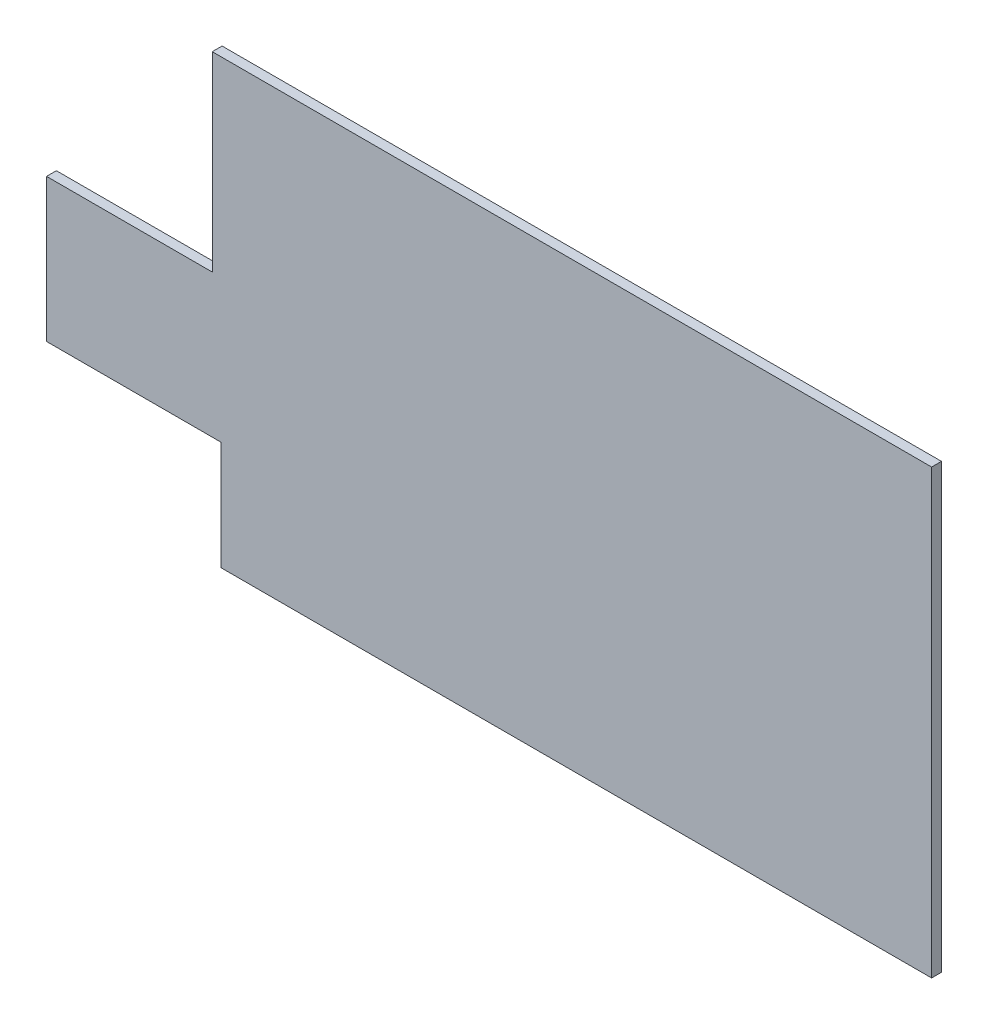
ISO-10303-21;
HEADER;
FILE_DESCRIPTION(('STEP AP214'),'2;1');
FILE_NAME('part.step','',(''),(''),'','','');
FILE_SCHEMA(('AUTOMOTIVE_DESIGN { 1 0 10303 214 1 1 1 1 }'));
ENDSEC;
DATA;
#1=APPLICATION_CONTEXT('core data for automotive mechanical design processes');
#2=APPLICATION_PROTOCOL_DEFINITION('international standard','automotive_design',2000,#1);
#3=PRODUCT_CONTEXT('',#1,'mechanical');
#4=PRODUCT('Part','Part','',(#3));
#5=PRODUCT_RELATED_PRODUCT_CATEGORY('part','',(#4));
#6=PRODUCT_DEFINITION_FORMATION('','',#4);
#7=PRODUCT_DEFINITION_CONTEXT('part definition',#1,'design');
#8=PRODUCT_DEFINITION('design','',#6,#7);
#9=PRODUCT_DEFINITION_SHAPE('','',#8);
#10=(LENGTH_UNIT() NAMED_UNIT(*) SI_UNIT(.MILLI.,.METRE.));
#11=(NAMED_UNIT(*) PLANE_ANGLE_UNIT() SI_UNIT($,.RADIAN.));
#12=(NAMED_UNIT(*) SI_UNIT($,.STERADIAN.) SOLID_ANGLE_UNIT());
#13=UNCERTAINTY_MEASURE_WITH_UNIT(LENGTH_MEASURE(1.E-05),#10,'distance_accuracy_value','');
#14=(GEOMETRIC_REPRESENTATION_CONTEXT(3) GLOBAL_UNCERTAINTY_ASSIGNED_CONTEXT((#13)) GLOBAL_UNIT_ASSIGNED_CONTEXT((#10,
#11,#12)) REPRESENTATION_CONTEXT('',''));
#15=CARTESIAN_POINT('',(0.,0.,0.));
#16=DIRECTION('',(0.,0.,1.));
#17=DIRECTION('',(1.,0.,0.));
#18=AXIS2_PLACEMENT_3D('',#15,#16,#17);
#19=CARTESIAN_POINT('',(90.,-45.,2.));
#20=DIRECTION('',(-1.,0.,0.));
#21=DIRECTION('',(0.,0.,1.));
#22=AXIS2_PLACEMENT_3D('',#19,#20,#21);
#23=PLANE('',#22);
#24=DIRECTION('',(0.,1.,0.));
#25=VECTOR('',#24,1.);
#26=CARTESIAN_POINT('',(90.,-45.,0.));
#27=LINE('',#26,#25);
#28=CARTESIAN_POINT('',(90.,-45.,0.));
#29=VERTEX_POINT('',#28);
#30=CARTESIAN_POINT('',(90.,45.,0.));
#31=VERTEX_POINT('',#30);
#32=EDGE_CURVE('E139',#29,#31,#27,.T.);
#33=ORIENTED_EDGE('',*,*,#32,.T.);
#34=DIRECTION('',(0.,0.,-1.));
#35=VECTOR('',#34,1.);
#36=CARTESIAN_POINT('',(90.,45.,2.));
#37=LINE('',#36,#35);
#38=CARTESIAN_POINT('',(90.,45.,2.));
#39=VERTEX_POINT('',#38);
#40=EDGE_CURVE('E162',#39,#31,#37,.T.);
#41=ORIENTED_EDGE('',*,*,#40,.F.);
#42=DIRECTION('',(0.,1.,0.));
#43=VECTOR('',#42,1.);
#44=CARTESIAN_POINT('',(90.,-45.,2.));
#45=LINE('',#44,#43);
#46=CARTESIAN_POINT('',(90.,-45.,2.));
#47=VERTEX_POINT('',#46);
#48=EDGE_CURVE('E140',#47,#39,#45,.T.);
#49=ORIENTED_EDGE('',*,*,#48,.F.);
#50=DIRECTION('',(0.,0.,-1.));
#51=VECTOR('',#50,1.);
#52=CARTESIAN_POINT('',(90.,-45.,2.));
#53=LINE('',#52,#51);
#54=EDGE_CURVE('E151',#47,#29,#53,.T.);
#55=ORIENTED_EDGE('',*,*,#54,.T.);
#56=EDGE_LOOP('',(#33,#41,#49,#55));
#57=FACE_BOUND('',#56,.T.);
#58=ADVANCED_FACE('F36',(#57),#23,.F.);
#59=CARTESIAN_POINT('',(-90.,45.,2.));
#60=DIRECTION('',(0.,-1.,0.));
#61=DIRECTION('',(0.,0.,-1.));
#62=AXIS2_PLACEMENT_3D('',#59,#60,#61);
#63=PLANE('',#62);
#64=DIRECTION('',(-1.,0.,0.));
#65=VECTOR('',#64,1.);
#66=CARTESIAN_POINT('',(-90.,45.,0.));
#67=LINE('',#66,#65);
#68=CARTESIAN_POINT('',(-56.3001921870523,45.,0.));
#69=VERTEX_POINT('',#68);
#70=EDGE_CURVE('E154',#31,#69,#67,.T.);
#71=ORIENTED_EDGE('',*,*,#70,.T.);
#72=DIRECTION('',(0.,0.,1.));
#73=VECTOR('',#72,1.);
#74=CARTESIAN_POINT('',(-56.3001921870523,45.,2.));
#75=LINE('',#74,#73);
#76=CARTESIAN_POINT('',(-56.3001921870523,45.,2.));
#77=VERTEX_POINT('',#76);
#78=EDGE_CURVE('E57',#69,#77,#75,.T.);
#79=ORIENTED_EDGE('',*,*,#78,.T.);
#80=DIRECTION('',(-1.,0.,0.));
#81=VECTOR('',#80,1.);
#82=CARTESIAN_POINT('',(-90.,45.,2.));
#83=LINE('',#82,#81);
#84=EDGE_CURVE('E143',#39,#77,#83,.T.);
#85=ORIENTED_EDGE('',*,*,#84,.F.);
#86=ORIENTED_EDGE('',*,*,#40,.T.);
#87=EDGE_LOOP('',(#71,#79,#85,#86));
#88=FACE_BOUND('',#87,.T.);
#89=ADVANCED_FACE('F175',(#88),#63,.F.);
#90=CARTESIAN_POINT('',(-90.,-45.,2.));
#91=DIRECTION('',(1.,0.,0.));
#92=DIRECTION('',(0.,0.,-1.));
#93=AXIS2_PLACEMENT_3D('',#90,#91,#92);
#94=PLANE('',#93);
#95=DIRECTION('',(0.,-1.,0.));
#96=VECTOR('',#95,1.);
#97=CARTESIAN_POINT('',(-90.,-45.,0.));
#98=LINE('',#97,#96);
#99=CARTESIAN_POINT('',(-90.,6.188839413241,0.));
#100=VERTEX_POINT('',#99);
#101=CARTESIAN_POINT('',(-90.,-22.8925823881525,0.));
#102=VERTEX_POINT('',#101);
#103=EDGE_CURVE('E157',#100,#102,#98,.T.);
#104=ORIENTED_EDGE('',*,*,#103,.T.);
#105=DIRECTION('',(0.,0.,1.));
#106=VECTOR('',#105,1.);
#107=CARTESIAN_POINT('',(-90.,-22.8925823881525,2.));
#108=LINE('',#107,#106);
#109=CARTESIAN_POINT('',(-90.,-22.8925823881525,2.));
#110=VERTEX_POINT('',#109);
#111=EDGE_CURVE('E49',#102,#110,#108,.T.);
#112=ORIENTED_EDGE('',*,*,#111,.T.);
#113=DIRECTION('',(0.,-1.,0.));
#114=VECTOR('',#113,1.);
#115=CARTESIAN_POINT('',(-90.,-45.,2.));
#116=LINE('',#115,#114);
#117=CARTESIAN_POINT('',(-90.,6.188839413241,2.));
#118=VERTEX_POINT('',#117);
#119=EDGE_CURVE('E146',#118,#110,#116,.T.);
#120=ORIENTED_EDGE('',*,*,#119,.F.);
#121=DIRECTION('',(0.,0.,-1.));
#122=VECTOR('',#121,1.);
#123=CARTESIAN_POINT('',(-90.,6.188839413241,2.));
#124=LINE('',#123,#122);
#125=EDGE_CURVE('E136',#118,#100,#124,.T.);
#126=ORIENTED_EDGE('',*,*,#125,.T.);
#127=EDGE_LOOP('',(#104,#112,#120,#126));
#128=FACE_BOUND('',#127,.T.);
#129=ADVANCED_FACE('F171',(#128),#94,.F.);
#130=CARTESIAN_POINT('',(-90.,-45.,2.));
#131=DIRECTION('',(0.,1.,0.));
#132=DIRECTION('',(0.,0.,1.));
#133=AXIS2_PLACEMENT_3D('',#130,#131,#132);
#134=PLANE('',#133);
#135=DIRECTION('',(1.,0.,0.));
#136=VECTOR('',#135,1.);
#137=CARTESIAN_POINT('',(-90.,-45.,2.));
#138=LINE('',#137,#136);
#139=CARTESIAN_POINT('',(-54.5159821179948,-45.,2.));
#140=VERTEX_POINT('',#139);
#141=EDGE_CURVE('E149',#140,#47,#138,.T.);
#142=ORIENTED_EDGE('',*,*,#141,.F.);
#143=DIRECTION('',(0.,0.,-1.));
#144=VECTOR('',#143,1.);
#145=CARTESIAN_POINT('',(-54.5159821179948,-45.,2.));
#146=LINE('',#145,#144);
#147=CARTESIAN_POINT('',(-54.5159821179948,-45.,0.));
#148=VERTEX_POINT('',#147);
#149=EDGE_CURVE('E123',#140,#148,#146,.T.);
#150=ORIENTED_EDGE('',*,*,#149,.T.);
#151=DIRECTION('',(1.,0.,0.));
#152=VECTOR('',#151,1.);
#153=CARTESIAN_POINT('',(-90.,-45.,0.));
#154=LINE('',#153,#152);
#155=EDGE_CURVE('E117',#148,#29,#154,.T.);
#156=ORIENTED_EDGE('',*,*,#155,.T.);
#157=ORIENTED_EDGE('',*,*,#54,.F.);
#158=EDGE_LOOP('',(#142,#150,#156,#157));
#159=FACE_BOUND('',#158,.T.);
#160=ADVANCED_FACE('F182',(#159),#134,.F.);
#161=CARTESIAN_POINT('',(0.,0.,2.));
#162=DIRECTION('',(0.,0.,-1.));
#163=DIRECTION('',(-1.,0.,0.));
#164=AXIS2_PLACEMENT_3D('',#161,#162,#163);
#165=PLANE('',#164);
#166=DIRECTION('',(1.,0.,0.));
#167=VECTOR('',#166,1.);
#168=CARTESIAN_POINT('',(0.,-22.8925823881525,2.));
#169=LINE('',#168,#167);
#170=CARTESIAN_POINT('',(-54.5159821179948,-22.8925823881525,2.));
#171=VERTEX_POINT('',#170);
#172=EDGE_CURVE('E108',#110,#171,#169,.T.);
#173=ORIENTED_EDGE('',*,*,#172,.T.);
#174=DIRECTION('',(0.,-1.,0.));
#175=VECTOR('',#174,1.);
#176=CARTESIAN_POINT('',(-54.5159821179948,0.,2.));
#177=LINE('',#176,#175);
#178=EDGE_CURVE('E106',#171,#140,#177,.T.);
#179=ORIENTED_EDGE('',*,*,#178,.T.);
#180=ORIENTED_EDGE('',*,*,#141,.T.);
#181=ORIENTED_EDGE('',*,*,#48,.T.);
#182=ORIENTED_EDGE('',*,*,#84,.T.);
#183=DIRECTION('',(0.,-1.,0.));
#184=VECTOR('',#183,1.);
#185=CARTESIAN_POINT('',(-56.3001921870523,0.,2.));
#186=LINE('',#185,#184);
#187=CARTESIAN_POINT('',(-56.3001921870523,6.188839413241,2.));
#188=VERTEX_POINT('',#187);
#189=EDGE_CURVE('E129',#77,#188,#186,.T.);
#190=ORIENTED_EDGE('',*,*,#189,.T.);
#191=DIRECTION('',(-1.,0.,0.));
#192=VECTOR('',#191,1.);
#193=CARTESIAN_POINT('',(0.,6.188839413241,2.));
#194=LINE('',#193,#192);
#195=EDGE_CURVE('E133',#188,#118,#194,.T.);
#196=ORIENTED_EDGE('',*,*,#195,.T.);
#197=ORIENTED_EDGE('',*,*,#119,.T.);
#198=EDGE_LOOP('',(#173,#179,#180,#181,#182,#190,#196,#197));
#199=FACE_BOUND('',#198,.T.);
#200=ADVANCED_FACE('F173',(#199),#165,.F.);
#201=CARTESIAN_POINT('',(0.,0.,0.));
#202=DIRECTION('',(0.,0.,-1.));
#203=DIRECTION('',(-1.,0.,0.));
#204=AXIS2_PLACEMENT_3D('',#201,#202,#203);
#205=PLANE('',#204);
#206=DIRECTION('',(0.,-1.,0.));
#207=VECTOR('',#206,1.);
#208=CARTESIAN_POINT('',(-54.5159821179948,-46.8341185294179,0.));
#209=LINE('',#208,#207);
#210=CARTESIAN_POINT('',(-54.5159821179948,-22.8925823881525,0.));
#211=VERTEX_POINT('',#210);
#212=EDGE_CURVE('E103',#211,#148,#209,.T.);
#213=ORIENTED_EDGE('',*,*,#212,.F.);
#214=DIRECTION('',(1.,0.,0.));
#215=VECTOR('',#214,1.);
#216=CARTESIAN_POINT('',(0.,-22.8925823881525,0.));
#217=LINE('',#216,#215);
#218=EDGE_CURVE('E11',#102,#211,#217,.T.);
#219=ORIENTED_EDGE('',*,*,#218,.F.);
#220=ORIENTED_EDGE('',*,*,#103,.F.);
#221=DIRECTION('',(-1.,0.,0.));
#222=VECTOR('',#221,1.);
#223=CARTESIAN_POINT('',(-94.8331141784138,6.188839413241,0.));
#224=LINE('',#223,#222);
#225=CARTESIAN_POINT('',(-56.3001921870523,6.188839413241,0.));
#226=VERTEX_POINT('',#225);
#227=EDGE_CURVE('E125',#226,#100,#224,.T.);
#228=ORIENTED_EDGE('',*,*,#227,.F.);
#229=DIRECTION('',(0.,-1.,0.));
#230=VECTOR('',#229,1.);
#231=CARTESIAN_POINT('',(-56.3001921870523,0.,0.));
#232=LINE('',#231,#230);
#233=EDGE_CURVE('E43',#69,#226,#232,.T.);
#234=ORIENTED_EDGE('',*,*,#233,.F.);
#235=ORIENTED_EDGE('',*,*,#70,.F.);
#236=ORIENTED_EDGE('',*,*,#32,.F.);
#237=ORIENTED_EDGE('',*,*,#155,.F.);
#238=EDGE_LOOP('',(#213,#219,#220,#228,#234,#235,#236,#237));
#239=FACE_BOUND('',#238,.T.);
#240=ADVANCED_FACE('F115',(#239),#205,.T.);
#241=CARTESIAN_POINT('',(-94.8331141784138,6.188839413241,10.));
#242=DIRECTION('',(0.,-1.,0.));
#243=DIRECTION('',(0.,0.,-1.));
#244=AXIS2_PLACEMENT_3D('',#241,#242,#243);
#245=PLANE('',#244);
#246=ORIENTED_EDGE('',*,*,#195,.F.);
#247=DIRECTION('',(0.,0.,-1.));
#248=VECTOR('',#247,1.);
#249=CARTESIAN_POINT('',(-56.3001921870523,6.188839413241,10.));
#250=LINE('',#249,#248);
#251=EDGE_CURVE('E127',#188,#226,#250,.T.);
#252=ORIENTED_EDGE('',*,*,#251,.T.);
#253=ORIENTED_EDGE('',*,*,#227,.T.);
#254=ORIENTED_EDGE('',*,*,#125,.F.);
#255=EDGE_LOOP('',(#246,#252,#253,#254));
#256=FACE_BOUND('',#255,.T.);
#257=ADVANCED_FACE('F168',(#256),#245,.F.);
#258=CARTESIAN_POINT('',(-56.3001921870523,45.3616688788685,10.));
#259=DIRECTION('',(1.,0.,0.));
#260=DIRECTION('',(0.,1.,0.));
#261=AXIS2_PLACEMENT_3D('',#258,#259,#260);
#262=PLANE('',#261);
#263=ORIENTED_EDGE('',*,*,#233,.T.);
#264=ORIENTED_EDGE('',*,*,#251,.F.);
#265=ORIENTED_EDGE('',*,*,#189,.F.);
#266=ORIENTED_EDGE('',*,*,#78,.F.);
#267=EDGE_LOOP('',(#263,#264,#265,#266));
#268=FACE_BOUND('',#267,.T.);
#269=ADVANCED_FACE('F166',(#268),#262,.F.);
#270=CARTESIAN_POINT('',(-54.5159821179948,-46.8341185294179,10.));
#271=DIRECTION('',(1.,0.,0.));
#272=DIRECTION('',(0.,0.,-1.));
#273=AXIS2_PLACEMENT_3D('',#270,#271,#272);
#274=PLANE('',#273);
#275=ORIENTED_EDGE('',*,*,#178,.F.);
#276=DIRECTION('',(0.,0.,-1.));
#277=VECTOR('',#276,1.);
#278=CARTESIAN_POINT('',(-54.5159821179948,-22.8925823881525,10.));
#279=LINE('',#278,#277);
#280=EDGE_CURVE('E100',#171,#211,#279,.T.);
#281=ORIENTED_EDGE('',*,*,#280,.T.);
#282=ORIENTED_EDGE('',*,*,#212,.T.);
#283=ORIENTED_EDGE('',*,*,#149,.F.);
#284=EDGE_LOOP('',(#275,#281,#282,#283));
#285=FACE_BOUND('',#284,.T.);
#286=ADVANCED_FACE('F101',(#285),#274,.F.);
#287=CARTESIAN_POINT('',(-91.234616538145,-22.8925823881525,10.));
#288=DIRECTION('',(0.,1.,0.));
#289=DIRECTION('',(0.,0.,1.));
#290=AXIS2_PLACEMENT_3D('',#287,#288,#289);
#291=PLANE('',#290);
#292=ORIENTED_EDGE('',*,*,#218,.T.);
#293=ORIENTED_EDGE('',*,*,#280,.F.);
#294=ORIENTED_EDGE('',*,*,#172,.F.);
#295=ORIENTED_EDGE('',*,*,#111,.F.);
#296=EDGE_LOOP('',(#292,#293,#294,#295));
#297=FACE_BOUND('',#296,.T.);
#298=ADVANCED_FACE('F110',(#297),#291,.F.);
#299=CLOSED_SHELL('',(#58,#89,#129,#160,#200,#240,#257,#269,#286,#298));
#300=MANIFOLD_SOLID_BREP('B2',#299);
#301=ADVANCED_BREP_SHAPE_REPRESENTATION('',(#18,#300),#14);
#302=SHAPE_DEFINITION_REPRESENTATION(#9,#301);
ENDSEC;
END-ISO-10303-21;
